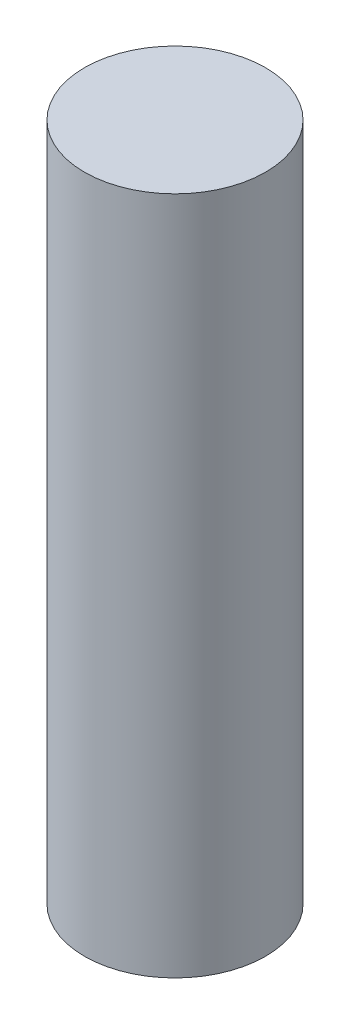
ISO-10303-21;
HEADER;
FILE_DESCRIPTION(('STEP AP214'),'2;1');
FILE_NAME('part.step','',(''),(''),'','','');
FILE_SCHEMA(('AUTOMOTIVE_DESIGN { 1 0 10303 214 1 1 1 1 }'));
ENDSEC;
DATA;
#1=APPLICATION_CONTEXT('core data for automotive mechanical design processes');
#2=APPLICATION_PROTOCOL_DEFINITION('international standard','automotive_design',2000,#1);
#3=PRODUCT_CONTEXT('',#1,'mechanical');
#4=PRODUCT('Part','Part','',(#3));
#5=PRODUCT_RELATED_PRODUCT_CATEGORY('part','',(#4));
#6=PRODUCT_DEFINITION_FORMATION('','',#4);
#7=PRODUCT_DEFINITION_CONTEXT('part definition',#1,'design');
#8=PRODUCT_DEFINITION('design','',#6,#7);
#9=PRODUCT_DEFINITION_SHAPE('','',#8);
#10=(LENGTH_UNIT() NAMED_UNIT(*) SI_UNIT(.MILLI.,.METRE.));
#11=(NAMED_UNIT(*) PLANE_ANGLE_UNIT() SI_UNIT($,.RADIAN.));
#12=(NAMED_UNIT(*) SI_UNIT($,.STERADIAN.) SOLID_ANGLE_UNIT());
#13=UNCERTAINTY_MEASURE_WITH_UNIT(LENGTH_MEASURE(1.E-05),#10,'distance_accuracy_value','');
#14=(GEOMETRIC_REPRESENTATION_CONTEXT(3) GLOBAL_UNCERTAINTY_ASSIGNED_CONTEXT((#13)) GLOBAL_UNIT_ASSIGNED_CONTEXT((#10,
#11,#12)) REPRESENTATION_CONTEXT('',''));
#15=CARTESIAN_POINT('',(0.,0.,0.));
#16=DIRECTION('',(0.,0.,1.));
#17=DIRECTION('',(1.,0.,0.));
#18=AXIS2_PLACEMENT_3D('',#15,#16,#17);
#19=CARTESIAN_POINT('',(0.,15.,0.));
#20=DIRECTION('',(0.,-1.,0.));
#21=DIRECTION('',(0.,0.,-1.));
#22=AXIS2_PLACEMENT_3D('',#19,#20,#21);
#23=CYLINDRICAL_SURFACE('',#22,2.);
#24=CARTESIAN_POINT('',(0.,15.,0.));
#25=DIRECTION('',(0.,1.,0.));
#26=DIRECTION('',(0.,0.,1.));
#27=AXIS2_PLACEMENT_3D('',#24,#25,#26);
#28=CIRCLE('',#27,2.);
#29=CARTESIAN_POINT('',(0.,15.,2.));
#30=VERTEX_POINT('',#29);
#31=EDGE_CURVE('E10',#30,#30,#28,.T.);
#32=ORIENTED_EDGE('',*,*,#31,.F.);
#33=EDGE_LOOP('',(#32));
#34=FACE_BOUND('',#33,.T.);
#35=CARTESIAN_POINT('',(0.,0.,0.));
#36=DIRECTION('',(0.,1.,0.));
#37=DIRECTION('',(0.,0.,1.));
#38=AXIS2_PLACEMENT_3D('',#35,#36,#37);
#39=CIRCLE('',#38,2.);
#40=CARTESIAN_POINT('',(0.,0.,2.));
#41=VERTEX_POINT('',#40);
#42=EDGE_CURVE('E34',#41,#41,#39,.T.);
#43=ORIENTED_EDGE('',*,*,#42,.T.);
#44=EDGE_LOOP('',(#43));
#45=FACE_BOUND('',#44,.T.);
#46=ADVANCED_FACE('F31',(#34,#45),#23,.T.);
#47=CARTESIAN_POINT('',(0.,15.,0.));
#48=DIRECTION('',(0.,1.,0.));
#49=DIRECTION('',(0.,0.,1.));
#50=AXIS2_PLACEMENT_3D('',#47,#48,#49);
#51=PLANE('',#50);
#52=ORIENTED_EDGE('',*,*,#31,.T.);
#53=EDGE_LOOP('',(#52));
#54=FACE_BOUND('',#53,.T.);
#55=ADVANCED_FACE('F46',(#54),#51,.T.);
#56=CARTESIAN_POINT('',(0.,0.,0.));
#57=DIRECTION('',(0.,1.,0.));
#58=DIRECTION('',(0.,0.,1.));
#59=AXIS2_PLACEMENT_3D('',#56,#57,#58);
#60=PLANE('',#59);
#61=ORIENTED_EDGE('',*,*,#42,.F.);
#62=EDGE_LOOP('',(#61));
#63=FACE_BOUND('',#62,.T.);
#64=ADVANCED_FACE('F44',(#63),#60,.F.);
#65=CLOSED_SHELL('',(#46,#55,#64));
#66=MANIFOLD_SOLID_BREP('B2',#65);
#67=ADVANCED_BREP_SHAPE_REPRESENTATION('',(#18,#66),#14);
#68=SHAPE_DEFINITION_REPRESENTATION(#9,#67);
ENDSEC;
END-ISO-10303-21;
